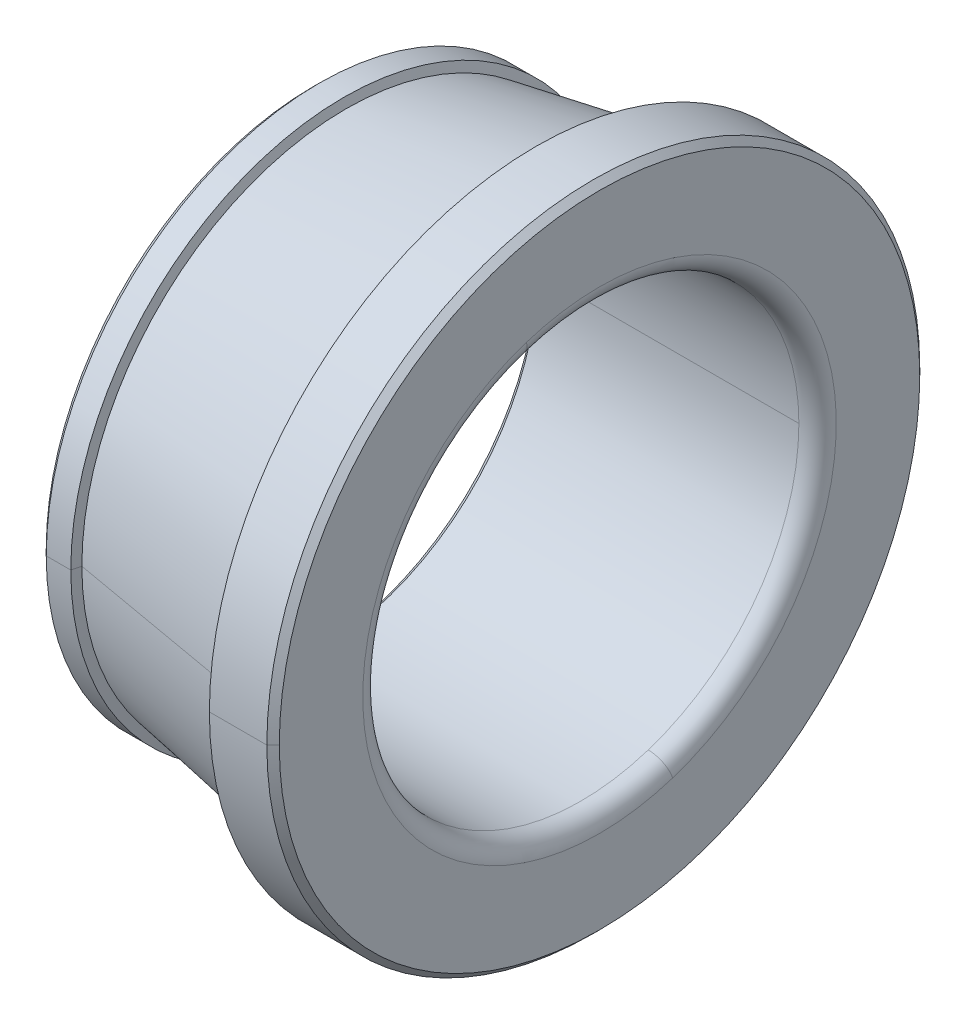
ISO-10303-21;
HEADER;
FILE_DESCRIPTION(('STEP AP214'),'2;1');
FILE_NAME('part.step','',(''),(''),'','','');
FILE_SCHEMA(('AUTOMOTIVE_DESIGN { 1 0 10303 214 1 1 1 1 }'));
ENDSEC;
DATA;
#1=APPLICATION_CONTEXT('core data for automotive mechanical design processes');
#2=APPLICATION_PROTOCOL_DEFINITION('international standard','automotive_design',2000,#1);
#3=PRODUCT_CONTEXT('',#1,'mechanical');
#4=PRODUCT('Part','Part','',(#3));
#5=PRODUCT_RELATED_PRODUCT_CATEGORY('part','',(#4));
#6=PRODUCT_DEFINITION_FORMATION('','',#4);
#7=PRODUCT_DEFINITION_CONTEXT('part definition',#1,'design');
#8=PRODUCT_DEFINITION('design','',#6,#7);
#9=PRODUCT_DEFINITION_SHAPE('','',#8);
#10=(LENGTH_UNIT() NAMED_UNIT(*) SI_UNIT(.MILLI.,.METRE.));
#11=(NAMED_UNIT(*) PLANE_ANGLE_UNIT() SI_UNIT($,.RADIAN.));
#12=(NAMED_UNIT(*) SI_UNIT($,.STERADIAN.) SOLID_ANGLE_UNIT());
#13=UNCERTAINTY_MEASURE_WITH_UNIT(LENGTH_MEASURE(1.E-05),#10,'distance_accuracy_value','');
#14=(GEOMETRIC_REPRESENTATION_CONTEXT(3) GLOBAL_UNCERTAINTY_ASSIGNED_CONTEXT((#13)) GLOBAL_UNIT_ASSIGNED_CONTEXT((#10,
#11,#12)) REPRESENTATION_CONTEXT('',''));
#15=CARTESIAN_POINT('',(0.,0.,0.));
#16=DIRECTION('',(0.,0.,1.));
#17=DIRECTION('',(1.,0.,0.));
#18=AXIS2_PLACEMENT_3D('',#15,#16,#17);
#19=CARTESIAN_POINT('',(1.25,21.403,0.));
#20=DIRECTION('',(-1.,0.,0.));
#21=DIRECTION('',(0.,0.,1.));
#22=AXIS2_PLACEMENT_3D('',#19,#20,#21);
#23=PLANE('',#22);
#24=CARTESIAN_POINT('',(1.25,0.,0.));
#25=DIRECTION('',(1.,0.,0.));
#26=DIRECTION('',(0.,0.,-1.));
#27=AXIS2_PLACEMENT_3D('',#24,#25,#26);
#28=CIRCLE('',#27,18.);
#29=CARTESIAN_POINT('',(1.25,0.,-18.));
#30=VERTEX_POINT('',#29);
#31=CARTESIAN_POINT('',(1.25,0.,18.));
#32=VERTEX_POINT('',#31);
#33=EDGE_CURVE('E11',#30,#32,#28,.T.);
#34=ORIENTED_EDGE('',*,*,#33,.T.);
#35=CARTESIAN_POINT('',(1.25,0.,0.));
#36=DIRECTION('',(1.,0.,0.));
#37=DIRECTION('',(0.,0.,-1.));
#38=AXIS2_PLACEMENT_3D('',#35,#36,#37);
#39=CIRCLE('',#38,18.);
#40=EDGE_CURVE('E25',#32,#30,#39,.T.);
#41=ORIENTED_EDGE('',*,*,#40,.T.);
#42=EDGE_LOOP('',(#34,#41));
#43=FACE_BOUND('',#42,.T.);
#44=CARTESIAN_POINT('',(1.25,0.,0.));
#45=DIRECTION('',(1.,0.,0.));
#46=DIRECTION('',(0.,0.,-1.));
#47=AXIS2_PLACEMENT_3D('',#44,#45,#46);
#48=CIRCLE('',#47,21.403);
#49=CARTESIAN_POINT('',(1.25,0.,21.403));
#50=VERTEX_POINT('',#49);
#51=CARTESIAN_POINT('',(1.25,0.,-21.403));
#52=VERTEX_POINT('',#51);
#53=EDGE_CURVE('E371',#50,#52,#48,.T.);
#54=ORIENTED_EDGE('',*,*,#53,.F.);
#55=CARTESIAN_POINT('',(1.25,0.,0.));
#56=DIRECTION('',(1.,0.,0.));
#57=DIRECTION('',(0.,0.,-1.));
#58=AXIS2_PLACEMENT_3D('',#55,#56,#57);
#59=CIRCLE('',#58,21.403);
#60=EDGE_CURVE('E366',#52,#50,#59,.T.);
#61=ORIENTED_EDGE('',*,*,#60,.F.);
#62=EDGE_LOOP('',(#54,#61));
#63=FACE_BOUND('',#62,.T.);
#64=ADVANCED_FACE('F17',(#43,#63),#23,.T.);
#65=CARTESIAN_POINT('',(1.75,0.,0.));
#66=DIRECTION('',(1.,0.,0.));
#67=DIRECTION('',(0.,-1.,0.));
#68=AXIS2_PLACEMENT_3D('',#65,#66,#67);
#69=CONICAL_SURFACE('',#68,21.903,0.785398163397448);
#70=DIRECTION('',(0.707106781186548,0.,0.707106781186548));
#71=VECTOR('',#70,1.);
#72=CARTESIAN_POINT('',(1.25,0.,21.403));
#73=LINE('',#72,#71);
#74=CARTESIAN_POINT('',(1.75,0.,21.903));
#75=VERTEX_POINT('',#74);
#76=EDGE_CURVE('E362',#50,#75,#73,.T.);
#77=ORIENTED_EDGE('',*,*,#76,.T.);
#78=CARTESIAN_POINT('',(1.75,0.,0.));
#79=DIRECTION('',(1.,0.,0.));
#80=DIRECTION('',(0.,0.,-1.));
#81=AXIS2_PLACEMENT_3D('',#78,#79,#80);
#82=CIRCLE('',#81,21.903);
#83=CARTESIAN_POINT('',(1.75,0.,-21.903));
#84=VERTEX_POINT('',#83);
#85=EDGE_CURVE('E357',#84,#75,#82,.T.);
#86=ORIENTED_EDGE('',*,*,#85,.F.);
#87=DIRECTION('',(0.707106781186548,0.,-0.707106781186548));
#88=VECTOR('',#87,1.);
#89=CARTESIAN_POINT('',(1.25,0.,-21.403));
#90=LINE('',#89,#88);
#91=EDGE_CURVE('E352',#52,#84,#90,.T.);
#92=ORIENTED_EDGE('',*,*,#91,.F.);
#93=ORIENTED_EDGE('',*,*,#60,.T.);
#94=EDGE_LOOP('',(#77,#86,#92,#93));
#95=FACE_BOUND('',#94,.T.);
#96=ADVANCED_FACE('F387',(#95),#69,.T.);
#97=CARTESIAN_POINT('',(1.75,0.,0.));
#98=DIRECTION('',(1.,0.,0.));
#99=DIRECTION('',(0.,1.,0.));
#100=AXIS2_PLACEMENT_3D('',#97,#98,#99);
#101=CONICAL_SURFACE('',#100,21.903,0.785398163397448);
#102=ORIENTED_EDGE('',*,*,#76,.F.);
#103=ORIENTED_EDGE('',*,*,#53,.T.);
#104=ORIENTED_EDGE('',*,*,#91,.T.);
#105=CARTESIAN_POINT('',(1.75,0.,0.));
#106=DIRECTION('',(1.,0.,0.));
#107=DIRECTION('',(0.,0.,-1.));
#108=AXIS2_PLACEMENT_3D('',#105,#106,#107);
#109=CIRCLE('',#108,21.903);
#110=EDGE_CURVE('E347',#75,#84,#109,.T.);
#111=ORIENTED_EDGE('',*,*,#110,.F.);
#112=EDGE_LOOP('',(#102,#103,#104,#111));
#113=FACE_BOUND('',#112,.T.);
#114=ADVANCED_FACE('F382',(#113),#101,.T.);
#115=CARTESIAN_POINT('',(24.25,0.,0.));
#116=DIRECTION('',(1.,0.,0.));
#117=DIRECTION('',(0.,1.,0.));
#118=AXIS2_PLACEMENT_3D('',#115,#116,#117);
#119=CYLINDRICAL_SURFACE('',#118,21.903);
#120=DIRECTION('',(1.,0.,0.));
#121=VECTOR('',#120,1.);
#122=CARTESIAN_POINT('',(1.75,0.,21.903));
#123=LINE('',#122,#121);
#124=CARTESIAN_POINT('',(3.7205763986054,0.,21.903));
#125=VERTEX_POINT('',#124);
#126=EDGE_CURVE('E342',#75,#125,#123,.T.);
#127=ORIENTED_EDGE('',*,*,#126,.F.);
#128=ORIENTED_EDGE('',*,*,#110,.T.);
#129=DIRECTION('',(1.,0.,0.));
#130=VECTOR('',#129,1.);
#131=CARTESIAN_POINT('',(1.75,0.,-21.903));
#132=LINE('',#131,#130);
#133=CARTESIAN_POINT('',(3.7205763986054,0.,-21.903));
#134=VERTEX_POINT('',#133);
#135=EDGE_CURVE('E338',#84,#134,#132,.T.);
#136=ORIENTED_EDGE('',*,*,#135,.T.);
#137=CARTESIAN_POINT('',(3.7205763986054,0.,0.));
#138=DIRECTION('',(1.,0.,0.));
#139=DIRECTION('',(0.,0.,-1.));
#140=AXIS2_PLACEMENT_3D('',#137,#138,#139);
#141=CIRCLE('',#140,21.903);
#142=EDGE_CURVE('E333',#125,#134,#141,.T.);
#143=ORIENTED_EDGE('',*,*,#142,.F.);
#144=EDGE_LOOP('',(#127,#128,#136,#143));
#145=FACE_BOUND('',#144,.T.);
#146=ADVANCED_FACE('F394',(#145),#119,.T.);
#147=CARTESIAN_POINT('',(3.8979340937361,0.,0.));
#148=DIRECTION('',(-1.,0.,0.));
#149=DIRECTION('',(0.,1.,0.));
#150=AXIS2_PLACEMENT_3D('',#147,#148,#149);
#151=CONICAL_SURFACE('',#150,21.193556407226,1.32582191298479);
#152=DIRECTION('',(-0.242531502591365,0.,-0.970143530747268));
#153=VECTOR('',#152,1.);
#154=CARTESIAN_POINT('',(3.8979340937361,0.,-21.193556407226));
#155=LINE('',#154,#153);
#156=CARTESIAN_POINT('',(3.8979340937361,0.,-21.193556407226));
#157=VERTEX_POINT('',#156);
#158=EDGE_CURVE('E328',#157,#134,#155,.T.);
#159=ORIENTED_EDGE('',*,*,#158,.F.);
#160=CARTESIAN_POINT('',(3.8979340937361,0.,0.));
#161=DIRECTION('',(1.,0.,0.));
#162=DIRECTION('',(0.,0.,-1.));
#163=AXIS2_PLACEMENT_3D('',#160,#161,#162);
#164=CIRCLE('',#163,21.193556407226);
#165=CARTESIAN_POINT('',(3.8979340937361,0.,21.193556407226));
#166=VERTEX_POINT('',#165);
#167=EDGE_CURVE('E323',#166,#157,#164,.T.);
#168=ORIENTED_EDGE('',*,*,#167,.F.);
#169=DIRECTION('',(-0.242531502591365,0.,0.970143530747268));
#170=VECTOR('',#169,1.);
#171=CARTESIAN_POINT('',(3.8979340937361,0.,21.193556407226));
#172=LINE('',#171,#170);
#173=EDGE_CURVE('E318',#166,#125,#172,.T.);
#174=ORIENTED_EDGE('',*,*,#173,.T.);
#175=ORIENTED_EDGE('',*,*,#142,.T.);
#176=EDGE_LOOP('',(#159,#168,#174,#175));
#177=FACE_BOUND('',#176,.T.);
#178=ADVANCED_FACE('F396',(#177),#151,.T.);
#179=CARTESIAN_POINT('',(3.8979340937361,0.,0.));
#180=DIRECTION('',(-1.,0.,0.));
#181=DIRECTION('',(0.,-1.,0.));
#182=AXIS2_PLACEMENT_3D('',#179,#180,#181);
#183=CONICAL_SURFACE('',#182,21.193556407226,1.32582191298479);
#184=ORIENTED_EDGE('',*,*,#158,.T.);
#185=CARTESIAN_POINT('',(3.7205763986054,0.,0.));
#186=DIRECTION('',(1.,0.,0.));
#187=DIRECTION('',(0.,0.,-1.));
#188=AXIS2_PLACEMENT_3D('',#185,#186,#187);
#189=CIRCLE('',#188,21.903);
#190=EDGE_CURVE('E313',#134,#125,#189,.T.);
#191=ORIENTED_EDGE('',*,*,#190,.T.);
#192=ORIENTED_EDGE('',*,*,#173,.F.);
#193=CARTESIAN_POINT('',(3.8979340937361,0.,0.));
#194=DIRECTION('',(1.,0.,0.));
#195=DIRECTION('',(0.,0.,-1.));
#196=AXIS2_PLACEMENT_3D('',#193,#194,#195);
#197=CIRCLE('',#196,21.193556407226);
#198=EDGE_CURVE('E308',#157,#166,#197,.T.);
#199=ORIENTED_EDGE('',*,*,#198,.F.);
#200=EDGE_LOOP('',(#184,#191,#192,#199));
#201=FACE_BOUND('',#200,.T.);
#202=ADVANCED_FACE('F401',(#201),#183,.T.);
#203=CARTESIAN_POINT('',(19.692398578943,0.,0.));
#204=DIRECTION('',(1.,0.,0.));
#205=DIRECTION('',(0.,-1.,0.));
#206=AXIS2_PLACEMENT_3D('',#203,#204,#205);
#207=CONICAL_SURFACE('',#206,23.985368814372,0.174951804219879);
#208=DIRECTION('',(0.984734929038769,0.,0.174060677727654));
#209=VECTOR('',#208,1.);
#210=CARTESIAN_POINT('',(3.89793409373609,0.,21.193556407226));
#211=LINE('',#210,#209);
#212=CARTESIAN_POINT('',(19.692398578943,0.,23.985368814372));
#213=VERTEX_POINT('',#212);
#214=EDGE_CURVE('E304',#166,#213,#211,.T.);
#215=ORIENTED_EDGE('',*,*,#214,.T.);
#216=CARTESIAN_POINT('',(19.692398578943,0.,0.));
#217=DIRECTION('',(1.,0.,0.));
#218=DIRECTION('',(0.,0.,-1.));
#219=AXIS2_PLACEMENT_3D('',#216,#217,#218);
#220=CIRCLE('',#219,23.985368814372);
#221=CARTESIAN_POINT('',(19.692398578943,0.,-23.985368814372));
#222=VERTEX_POINT('',#221);
#223=EDGE_CURVE('E299',#222,#213,#220,.T.);
#224=ORIENTED_EDGE('',*,*,#223,.F.);
#225=DIRECTION('',(0.984734929038769,0.,-0.174060677727654));
#226=VECTOR('',#225,1.);
#227=CARTESIAN_POINT('',(3.89793409373609,0.,-21.193556407226));
#228=LINE('',#227,#226);
#229=EDGE_CURVE('E294',#157,#222,#228,.T.);
#230=ORIENTED_EDGE('',*,*,#229,.F.);
#231=ORIENTED_EDGE('',*,*,#198,.T.);
#232=EDGE_LOOP('',(#215,#224,#230,#231));
#233=FACE_BOUND('',#232,.T.);
#234=ADVANCED_FACE('F408',(#233),#207,.T.);
#235=CARTESIAN_POINT('',(19.692398578943,0.,0.));
#236=DIRECTION('',(1.,0.,0.));
#237=DIRECTION('',(0.,1.,0.));
#238=AXIS2_PLACEMENT_3D('',#235,#236,#237);
#239=CONICAL_SURFACE('',#238,23.985368814372,0.174951804219879);
#240=ORIENTED_EDGE('',*,*,#214,.F.);
#241=ORIENTED_EDGE('',*,*,#167,.T.);
#242=ORIENTED_EDGE('',*,*,#229,.T.);
#243=CARTESIAN_POINT('',(19.692398578943,0.,0.));
#244=DIRECTION('',(1.,0.,0.));
#245=DIRECTION('',(0.,0.,-1.));
#246=AXIS2_PLACEMENT_3D('',#243,#244,#245);
#247=CIRCLE('',#246,23.985368814372);
#248=EDGE_CURVE('E289',#213,#222,#247,.T.);
#249=ORIENTED_EDGE('',*,*,#248,.F.);
#250=EDGE_LOOP('',(#240,#241,#242,#249));
#251=FACE_BOUND('',#250,.T.);
#252=ADVANCED_FACE('F405',(#251),#239,.T.);
#253=CARTESIAN_POINT('',(19.138750781362,0.,0.));
#254=DIRECTION('',(-1.,0.,0.));
#255=DIRECTION('',(0.,1.,0.));
#256=AXIS2_PLACEMENT_3D('',#253,#254,#255);
#257=CONICAL_SURFACE('',#256,26.2,1.32582191298495);
#258=DIRECTION('',(-0.242531502591207,0.,-0.970143530747307));
#259=VECTOR('',#258,1.);
#260=CARTESIAN_POINT('',(19.692398578943,0.,-23.985368814372));
#261=LINE('',#260,#259);
#262=CARTESIAN_POINT('',(19.138750781362,0.,-26.2));
#263=VERTEX_POINT('',#262);
#264=EDGE_CURVE('E285',#222,#263,#261,.T.);
#265=ORIENTED_EDGE('',*,*,#264,.T.);
#266=CARTESIAN_POINT('',(19.138750781362,0.,0.));
#267=DIRECTION('',(1.,0.,0.));
#268=DIRECTION('',(0.,0.,-1.));
#269=AXIS2_PLACEMENT_3D('',#266,#267,#268);
#270=CIRCLE('',#269,26.2);
#271=CARTESIAN_POINT('',(19.138750781362,0.,26.2));
#272=VERTEX_POINT('',#271);
#273=EDGE_CURVE('E280',#272,#263,#270,.T.);
#274=ORIENTED_EDGE('',*,*,#273,.F.);
#275=DIRECTION('',(-0.242531502591207,0.,0.970143530747307));
#276=VECTOR('',#275,1.);
#277=CARTESIAN_POINT('',(19.692398578943,0.,23.985368814372));
#278=LINE('',#277,#276);
#279=EDGE_CURVE('E275',#213,#272,#278,.T.);
#280=ORIENTED_EDGE('',*,*,#279,.F.);
#281=ORIENTED_EDGE('',*,*,#248,.T.);
#282=EDGE_LOOP('',(#265,#274,#280,#281));
#283=FACE_BOUND('',#282,.T.);
#284=ADVANCED_FACE('F410',(#283),#257,.F.);
#285=CARTESIAN_POINT('',(19.138750781362,0.,0.));
#286=DIRECTION('',(-1.,0.,0.));
#287=DIRECTION('',(0.,-1.,0.));
#288=AXIS2_PLACEMENT_3D('',#285,#286,#287);
#289=CONICAL_SURFACE('',#288,26.2,1.32582191298495);
#290=ORIENTED_EDGE('',*,*,#264,.F.);
#291=ORIENTED_EDGE('',*,*,#223,.T.);
#292=ORIENTED_EDGE('',*,*,#279,.T.);
#293=CARTESIAN_POINT('',(19.138750781362,0.,0.));
#294=DIRECTION('',(1.,0.,0.));
#295=DIRECTION('',(0.,0.,-1.));
#296=AXIS2_PLACEMENT_3D('',#293,#294,#295);
#297=CIRCLE('',#296,26.2);
#298=EDGE_CURVE('E270',#263,#272,#297,.T.);
#299=ORIENTED_EDGE('',*,*,#298,.F.);
#300=EDGE_LOOP('',(#290,#291,#292,#299));
#301=FACE_BOUND('',#300,.T.);
#302=ADVANCED_FACE('F415',(#301),#289,.F.);
#303=CARTESIAN_POINT('',(24.25,0.,0.));
#304=DIRECTION('',(1.,0.,0.));
#305=DIRECTION('',(0.,-1.,0.));
#306=AXIS2_PLACEMENT_3D('',#303,#304,#305);
#307=CYLINDRICAL_SURFACE('',#306,26.2);
#308=DIRECTION('',(1.,0.,0.));
#309=VECTOR('',#308,1.);
#310=CARTESIAN_POINT('',(19.138750781362,0.,26.2));
#311=LINE('',#310,#309);
#312=CARTESIAN_POINT('',(23.75,0.,26.2));
#313=VERTEX_POINT('',#312);
#314=EDGE_CURVE('E266',#272,#313,#311,.T.);
#315=ORIENTED_EDGE('',*,*,#314,.T.);
#316=CARTESIAN_POINT('',(23.75,0.,0.));
#317=DIRECTION('',(1.,0.,0.));
#318=DIRECTION('',(0.,0.,-1.));
#319=AXIS2_PLACEMENT_3D('',#316,#317,#318);
#320=CIRCLE('',#319,26.2);
#321=CARTESIAN_POINT('',(23.75,0.,-26.2));
#322=VERTEX_POINT('',#321);
#323=EDGE_CURVE('E261',#322,#313,#320,.T.);
#324=ORIENTED_EDGE('',*,*,#323,.F.);
#325=DIRECTION('',(1.,0.,0.));
#326=VECTOR('',#325,1.);
#327=CARTESIAN_POINT('',(19.138750781362,0.,-26.2));
#328=LINE('',#327,#326);
#329=EDGE_CURVE('E256',#263,#322,#328,.T.);
#330=ORIENTED_EDGE('',*,*,#329,.F.);
#331=ORIENTED_EDGE('',*,*,#298,.T.);
#332=EDGE_LOOP('',(#315,#324,#330,#331));
#333=FACE_BOUND('',#332,.T.);
#334=ADVANCED_FACE('F421',(#333),#307,.T.);
#335=CARTESIAN_POINT('',(24.25,0.,0.));
#336=DIRECTION('',(1.,0.,0.));
#337=DIRECTION('',(0.,1.,0.));
#338=AXIS2_PLACEMENT_3D('',#335,#336,#337);
#339=CYLINDRICAL_SURFACE('',#338,26.2);
#340=ORIENTED_EDGE('',*,*,#314,.F.);
#341=ORIENTED_EDGE('',*,*,#273,.T.);
#342=ORIENTED_EDGE('',*,*,#329,.T.);
#343=CARTESIAN_POINT('',(23.75,0.,0.));
#344=DIRECTION('',(1.,0.,0.));
#345=DIRECTION('',(0.,0.,-1.));
#346=AXIS2_PLACEMENT_3D('',#343,#344,#345);
#347=CIRCLE('',#346,26.2);
#348=EDGE_CURVE('E251',#313,#322,#347,.T.);
#349=ORIENTED_EDGE('',*,*,#348,.F.);
#350=EDGE_LOOP('',(#340,#341,#342,#349));
#351=FACE_BOUND('',#350,.T.);
#352=ADVANCED_FACE('F419',(#351),#339,.T.);
#353=CARTESIAN_POINT('',(24.25,0.,0.));
#354=DIRECTION('',(-1.,0.,0.));
#355=DIRECTION('',(0.,1.,0.));
#356=AXIS2_PLACEMENT_3D('',#353,#354,#355);
#357=CONICAL_SURFACE('',#356,25.7,0.785398163397448);
#358=DIRECTION('',(-0.707106781186548,0.,-0.707106781186548));
#359=VECTOR('',#358,1.);
#360=CARTESIAN_POINT('',(24.25,0.,-25.7));
#361=LINE('',#360,#359);
#362=CARTESIAN_POINT('',(24.25,0.,-25.7));
#363=VERTEX_POINT('',#362);
#364=EDGE_CURVE('E246',#363,#322,#361,.T.);
#365=ORIENTED_EDGE('',*,*,#364,.F.);
#366=CARTESIAN_POINT('',(24.25,0.,0.));
#367=DIRECTION('',(1.,0.,0.));
#368=DIRECTION('',(0.,0.,-1.));
#369=AXIS2_PLACEMENT_3D('',#366,#367,#368);
#370=CIRCLE('',#369,25.7);
#371=CARTESIAN_POINT('',(24.25,0.,25.7));
#372=VERTEX_POINT('',#371);
#373=EDGE_CURVE('E241',#372,#363,#370,.T.);
#374=ORIENTED_EDGE('',*,*,#373,.F.);
#375=DIRECTION('',(-0.707106781186548,0.,0.707106781186548));
#376=VECTOR('',#375,1.);
#377=CARTESIAN_POINT('',(24.25,0.,25.7));
#378=LINE('',#377,#376);
#379=EDGE_CURVE('E236',#372,#313,#378,.T.);
#380=ORIENTED_EDGE('',*,*,#379,.T.);
#381=ORIENTED_EDGE('',*,*,#348,.T.);
#382=EDGE_LOOP('',(#365,#374,#380,#381));
#383=FACE_BOUND('',#382,.T.);
#384=ADVANCED_FACE('F427',(#383),#357,.T.);
#385=CARTESIAN_POINT('',(24.25,0.,0.));
#386=DIRECTION('',(-1.,0.,0.));
#387=DIRECTION('',(0.,-1.,0.));
#388=AXIS2_PLACEMENT_3D('',#385,#386,#387);
#389=CONICAL_SURFACE('',#388,25.7,0.785398163397448);
#390=ORIENTED_EDGE('',*,*,#364,.T.);
#391=ORIENTED_EDGE('',*,*,#323,.T.);
#392=ORIENTED_EDGE('',*,*,#379,.F.);
#393=CARTESIAN_POINT('',(24.25,0.,0.));
#394=DIRECTION('',(1.,0.,0.));
#395=DIRECTION('',(0.,0.,-1.));
#396=AXIS2_PLACEMENT_3D('',#393,#394,#395);
#397=CIRCLE('',#396,25.7);
#398=EDGE_CURVE('E233',#363,#372,#397,.T.);
#399=ORIENTED_EDGE('',*,*,#398,.F.);
#400=EDGE_LOOP('',(#390,#391,#392,#399));
#401=FACE_BOUND('',#400,.T.);
#402=ADVANCED_FACE('F424',(#401),#389,.T.);
#403=CARTESIAN_POINT('',(24.25,19.,0.));
#404=DIRECTION('',(1.,0.,0.));
#405=DIRECTION('',(0.,0.,-1.));
#406=AXIS2_PLACEMENT_3D('',#403,#404,#405);
#407=PLANE('',#406);
#408=ORIENTED_EDGE('',*,*,#398,.T.);
#409=ORIENTED_EDGE('',*,*,#373,.T.);
#410=EDGE_LOOP('',(#408,#409));
#411=FACE_BOUND('',#410,.T.);
#412=CARTESIAN_POINT('',(24.25,-18.0700738096073,-5.87132289312385));
#413=CARTESIAN_POINT('',(24.25,-17.9740106883257,-6.1669961208765));
#414=CARTESIAN_POINT('',(24.25,-17.8706785644181,-6.46030691648312));
#415=CARTESIAN_POINT('',(24.25,-17.6497523450558,-7.04150733217232));
#416=CARTESIAN_POINT('',(24.25,-17.532158249601,-7.3293969522549));
#417=CARTESIAN_POINT('',(24.25,-17.282984120849,-7.89905870566403));
#418=CARTESIAN_POINT('',(24.25,-17.1514040875517,-8.18083083899057));
#419=CARTESIAN_POINT('',(24.25,-16.8745770164577,-8.73757954465673));
#420=CARTESIAN_POINT('',(24.25,-16.7293299786609,-9.01255611699636));
#421=CARTESIAN_POINT('',(24.25,-16.4255182901043,-9.55505105988739));
#422=CARTESIAN_POINT('',(24.25,-16.2669536393443,-9.8225694304388));
#423=CARTESIAN_POINT('',(24.25,-15.9368888606755,-10.349503547662));
#424=CARTESIAN_POINT('',(24.25,-15.7653887327666,-10.6089192943337));
#425=CARTESIAN_POINT('',(24.25,-15.4098661212019,-11.1190231943149));
#426=CARTESIAN_POINT('',(24.25,-15.2258436375461,-11.3697113476243));
#427=CARTESIAN_POINT('',(24.25,-14.845719650798,-11.861756134974));
#428=CARTESIAN_POINT('',(24.25,-14.6496181477056,-12.1031127690142));
#429=CARTESIAN_POINT('',(24.25,-14.2458085450946,-12.5759130675321));
#430=CARTESIAN_POINT('',(24.25,-14.0381004455759,-12.8073567320098));
#431=CARTESIAN_POINT('',(24.25,-13.611578037837,-13.2597735236167));
#432=CARTESIAN_POINT('',(24.25,-13.3927637296169,-13.4807466507459));
#433=CARTESIAN_POINT('',(24.25,-12.9445560471164,-13.9116900239642));
#434=CARTESIAN_POINT('',(24.25,-12.7151626728362,-14.1216602700532));
#435=CARTESIAN_POINT('',(24.25,-12.2463494869985,-14.5300920444969));
#436=CARTESIAN_POINT('',(24.25,-12.0069296754411,-14.7285535728515));
#437=CARTESIAN_POINT('',(24.25,-11.5186403983318,-15.1134898006159));
#438=CARTESIAN_POINT('',(24.25,-11.26977093278,-15.2999645000257));
#439=CARTESIAN_POINT('',(24.25,-10.7631818960268,-15.6604778360179));
#440=CARTESIAN_POINT('',(24.25,-10.5054623248252,-15.8345164726003));
#441=CARTESIAN_POINT('',(24.25,-9.9817939457921,-16.1697384086176));
#442=CARTESIAN_POINT('',(24.25,-9.71584513796047,-16.3309217080526));
#443=CARTESIAN_POINT('',(24.25,-9.17635897963978,-16.640044665089));
#444=CARTESIAN_POINT('',(24.25,-8.90282162915072,-16.7879843226904));
#445=CARTESIAN_POINT('',(24.25,-8.34881736095149,-17.0702635964665));
#446=CARTESIAN_POINT('',(24.25,-8.06835044324131,-17.2046032126411));
#447=CARTESIAN_POINT('',(24.25,-7.5011627099706,-17.4593587676615));
#448=CARTESIAN_POINT('',(24.25,-7.21444189441008,-17.5797747065073));
#449=CARTESIAN_POINT('',(24.25,-6.63543710099715,-17.8063928143261));
#450=CARTESIAN_POINT('',(24.25,-6.34315312314475,-17.9125949832991));
#451=CARTESIAN_POINT('',(24.25,-5.75372614285175,-18.1105297010451));
#452=CARTESIAN_POINT('',(24.25,-5.45658314041116,-18.2022622498181));
#453=CARTESIAN_POINT('',(24.25,-4.85815395446133,-18.3710367354193));
#454=CARTESIAN_POINT('',(24.25,-4.55686777095209,-18.4480786722475));
#455=CARTESIAN_POINT('',(24.25,-3.95087804767059,-18.5872863331851));
#456=CARTESIAN_POINT('',(24.25,-3.64617450789832,-18.6494520572945));
#457=CARTESIAN_POINT('',(24.25,-3.03408412960695,-18.7587575301202));
#458=CARTESIAN_POINT('',(24.25,-2.72669729108785,-18.8058972788364));
#459=CARTESIAN_POINT('',(24.25,-2.10998083712071,-18.8850372370921));
#460=CARTESIAN_POINT('',(24.25,-1.80065122167267,-18.9170374466316));
#461=CARTESIAN_POINT('',(24.25,-1.18079441598535,-18.9658212352261));
#462=CARTESIAN_POINT('',(24.25,-0.870267225746063,-18.982604814281));
#463=CARTESIAN_POINT('',(24.25,-0.248763357676506,-19.0009149087946));
#464=CARTESIAN_POINT('',(24.25,0.0622133201537652,-19.0024414242531));
#465=CARTESIAN_POINT('',(24.25,0.683866993350071,-18.9902337140642));
#466=CARTESIAN_POINT('',(24.25,0.994543988716105,-18.9764994884168));
#467=CARTESIAN_POINT('',(24.25,1.61484984889,-18.9338033829686));
#468=CARTESIAN_POINT('',(24.25,1.92447871369786,-18.9048415031678));
#469=CARTESIAN_POINT('',(24.25,2.5419423896998,-18.8317598611182));
#470=CARTESIAN_POINT('',(24.25,2.84977720089388,-18.7876400988692));
#471=CARTESIAN_POINT('',(24.25,3.46291116864497,-18.6843489802949));
#472=CARTESIAN_POINT('',(24.25,3.76821032520196,-18.6251776239695));
#473=CARTESIAN_POINT('',(24.25,4.37553749126967,-18.4919258662225));
#474=CARTESIAN_POINT('',(24.25,4.67756550078038,-18.4178454648008));
#475=CARTESIAN_POINT('',(24.25,5.27762276082609,-18.2549540830369));
#476=CARTESIAN_POINT('',(24.25,5.57565201136108,-18.1661431026946));
#477=CARTESIAN_POINT('',(24.25,6.16699377488651,-17.9740045165201));
#478=CARTESIAN_POINT('',(24.25,6.46030628787696,-17.8706769106878));
#479=CARTESIAN_POINT('',(24.25,7.04150796077838,-17.6497539987862));
#480=CARTESIAN_POINT('',(24.25,7.32939712068935,-17.5321586927168));
#481=CARTESIAN_POINT('',(24.25,7.89905853722948,-17.2829836777333));
#482=CARTESIAN_POINT('',(24.25,8.18083079385864,-17.1514039688192));
#483=CARTESIAN_POINT('',(24.25,8.73757958978858,-16.8745771351902));
#484=CARTESIAN_POINT('',(24.25,9.01255612908936,-16.7293300104752));
#485=CARTESIAN_POINT('',(24.25,9.55505104779429,-16.42551825829));
#486=CARTESIAN_POINT('',(24.25,9.82256942719843,-16.2669536308198));
#487=CARTESIAN_POINT('',(24.25,10.3495035509022,-15.9368888692002));
#488=CARTESIAN_POINT('',(24.25,10.6089192952019,-15.7653887350508));
#489=CARTESIAN_POINT('',(24.25,11.1190231934466,-15.4098661189178));
#490=CARTESIAN_POINT('',(24.25,11.3697113473917,-15.2258436369341));
#491=CARTESIAN_POINT('',(24.25,11.8617561352066,-14.8457196514101));
#492=CARTESIAN_POINT('',(24.25,12.1031127690765,-14.6496181478697));
#493=CARTESIAN_POINT('',(24.25,12.5759130674697,-14.2458085449306));
#494=CARTESIAN_POINT('',(24.25,12.8073567319931,-14.038100445532));
#495=CARTESIAN_POINT('',(24.25,13.2597735236334,-13.611578037881));
#496=CARTESIAN_POINT('',(24.25,13.4807466507503,-13.3927637296287));
#497=CARTESIAN_POINT('',(24.25,13.9116900239597,-12.9445560471047));
#498=CARTESIAN_POINT('',(24.25,14.121660270052,-12.7151626728331));
#499=CARTESIAN_POINT('',(24.25,14.5300920444981,-12.2463494870017));
#500=CARTESIAN_POINT('',(24.25,14.7285535728518,-12.006929675442));
#501=CARTESIAN_POINT('',(24.25,15.1134898006155,-11.518640398331));
#502=CARTESIAN_POINT('',(24.25,15.2999645000256,-11.2697709327799));
#503=CARTESIAN_POINT('',(24.25,15.660477836018,-10.763181896027));
#504=CARTESIAN_POINT('',(24.25,15.8345164726003,-10.5054623248254));
#505=CARTESIAN_POINT('',(24.25,16.1697384086176,-9.98179394579209));
#506=CARTESIAN_POINT('',(24.25,16.3309217080526,-9.71584513796051));
#507=CARTESIAN_POINT('',(24.25,16.640044665089,-9.17635897963985));
#508=CARTESIAN_POINT('',(24.25,16.7879843226904,-8.90282162915078));
#509=CARTESIAN_POINT('',(24.25,17.0702635964665,-8.34881736095154));
#510=CARTESIAN_POINT('',(24.25,17.2046032126411,-8.06835044324136));
#511=CARTESIAN_POINT('',(24.25,17.4593587676615,-7.50116270997065));
#512=CARTESIAN_POINT('',(24.25,17.5797747065074,-7.21444189441012));
#513=CARTESIAN_POINT('',(24.25,17.806392814326,-6.63543710099722));
#514=CARTESIAN_POINT('',(24.25,17.9125949832989,-6.34315312314486));
#515=CARTESIAN_POINT('',(24.25,18.1105297010454,-5.75372614285174));
#516=CARTESIAN_POINT('',(24.25,18.202262249819,-5.45658314041098));
#517=CARTESIAN_POINT('',(24.25,18.3710367354184,-4.85815395446162));
#518=CARTESIAN_POINT('',(24.25,18.4480786722442,-4.55686777095303));
#519=CARTESIAN_POINT('',(24.25,18.5872863331883,-3.95087804766975));
#520=CARTESIAN_POINT('',(24.25,18.6494520573067,-3.64617450789507));
#521=CARTESIAN_POINT('',(24.25,18.758757530108,-3.03408412961031));
#522=CARTESIAN_POINT('',(24.25,18.8058972787911,-2.72669729110022));
#523=CARTESIAN_POINT('',(24.25,18.8850372371375,-2.10998083710845));
#524=CARTESIAN_POINT('',(24.25,18.9170374468009,-1.80065122162677));
#525=CARTESIAN_POINT('',(24.25,18.9658212350567,-1.18079441603137));
#526=CARTESIAN_POINT('',(24.25,18.9826048136491,-0.870267225917663));
#527=CARTESIAN_POINT('',(24.25,19.0009149094265,-0.248763357505038));
#528=CARTESIAN_POINT('',(24.25,19.0024414266113,0.0622133207938759));
#529=CARTESIAN_POINT('',(24.25,18.9902337117059,0.683866992709833));
#530=CARTESIAN_POINT('',(24.25,18.9764994796156,0.994543986326876));
#531=CARTESIAN_POINT('',(24.25,18.9338033917698,1.6148498512791));
#532=CARTESIAN_POINT('',(24.25,18.9048415360143,1.92447872261428));
#533=CARTESIAN_POINT('',(24.25,18.8317598282718,2.54194238078328));
#534=CARTESIAN_POINT('',(24.25,18.7876399762848,2.8497771676171));
#535=CARTESIAN_POINT('',(24.25,18.6843491028794,3.46291120192167));
#536=CARTESIAN_POINT('',(24.25,18.625178081461,3.76821044939242));
#537=CARTESIAN_POINT('',(24.25,18.491925408731,4.37553736707912));
#538=CARTESIAN_POINT('',(24.25,18.4178437574195,4.67756503729506));
#539=CARTESIAN_POINT('',(24.25,18.2549557904182,5.27762322431132));
#540=CARTESIAN_POINT('',(24.25,18.1661494747286,5.57565374111164));
#541=CARTESIAN_POINT('',(24.25,18.0700738096074,5.87132289312374));
#542=B_SPLINE_CURVE_WITH_KNOTS('',3,(#412,#413,#414,#415,#416,#417,#418,#419,#420,#421,#422,
#423,#424,#425,#426,#427,#428,#429,#430,#431,#432,#433,#434,#435,#436,#437,#438,#439,#440,#441,
#442,#443,#444,#445,#446,#447,#448,#449,#450,#451,#452,#453,#454,#455,#456,#457,#458,#459,#460,
#461,#462,#463,#464,#465,#466,#467,#468,#469,#470,#471,#472,#473,#474,#475,#476,#477,#478,#479,
#480,#481,#482,#483,#484,#485,#486,#487,#488,#489,#490,#491,#492,#493,#494,#495,#496,#497,#498,
#499,#500,#501,#502,#503,#504,#505,#506,#507,#508,#509,#510,#511,#512,#513,#514,#515,#516,#517,
#518,#519,#520,#521,#522,#523,#524,#525,#526,#527,#528,#529,#530,#531,#532,#533,#534,#535,#536,
#537,#538,#539,#540,#541),.UNSPECIFIED.,.F.,.F.,(4,2,2,2,2,2,2,2,2,2,2,2,2,2,2,2,2,2,2,2,2,2,2,
2,2,2,2,2,2,2,2,2,2,2,2,2,2,2,2,2,2,2,2,2,2,2,2,2,2,2,2,2,2,2,2,2,2,2,2,2,2,2,2,2,4),(0.,
0.932566683870634,1.86513336774127,2.79770005161191,3.73026673548254,4.66283341935317,
5.59540010322381,6.52796678709445,7.46053347096509,8.39310015483572,9.32566683870635,
10.258233522577,11.1908002064476,12.1233668903183,13.0559335741889,13.9885002580595,
14.9210669419302,15.8536336258008,16.7862003096714,17.7187669935421,18.6513336774127,
19.5839003612833,20.516467045154,21.4490337290246,22.3816004128953,23.3141670967659,
24.2467337806365,25.1793004645072,26.1118671483778,27.0444338322484,27.9770005161191,
28.9095671999897,29.8421338838603,30.774700567731,31.7072672516016,32.6398339354722,
33.5724006193429,34.5049673032135,35.4375339870842,36.3701006709548,37.3026673548254,
38.2352340386961,39.1678007225667,40.1003674064373,41.032934090308,41.9655007741786,
42.8980674580492,43.8306341419199,44.7632008257905,45.6957675096612,46.6283341935318,
47.5609008774024,48.4934675612731,49.4260342451437,50.3586009290143,51.291167612885,
52.2237342967556,53.1563009806262,54.0888676644969,55.0214343483675,55.9540010322382,
56.8865677161088,57.8191343999794,58.7517010838501,59.6842677677207),.UNSPECIFIED.);
#543=CARTESIAN_POINT('',(24.25,-18.0700738096073,-5.87132289312381));
#544=VERTEX_POINT('',#543);
#545=CARTESIAN_POINT('',(24.25,18.0700738096073,5.87132289312381));
#546=VERTEX_POINT('',#545);
#547=EDGE_CURVE('E232',#544,#546,#542,.T.);
#548=ORIENTED_EDGE('',*,*,#547,.F.);
#549=CARTESIAN_POINT('',(24.25,18.0700738096073,5.87132289312385));
#550=CARTESIAN_POINT('',(24.25,17.9740106883257,6.1669961208765));
#551=CARTESIAN_POINT('',(24.25,17.8706785644181,6.46030691648312));
#552=CARTESIAN_POINT('',(24.25,17.6497523450558,7.04150733217232));
#553=CARTESIAN_POINT('',(24.25,17.532158249601,7.3293969522549));
#554=CARTESIAN_POINT('',(24.25,17.282984120849,7.89905870566403));
#555=CARTESIAN_POINT('',(24.25,17.1514040875517,8.18083083899057));
#556=CARTESIAN_POINT('',(24.25,16.8745770164577,8.73757954465674));
#557=CARTESIAN_POINT('',(24.25,16.7293299786609,9.01255611699636));
#558=CARTESIAN_POINT('',(24.25,16.4255182901043,9.55505105988739));
#559=CARTESIAN_POINT('',(24.25,16.2669536393443,9.8225694304388));
#560=CARTESIAN_POINT('',(24.25,15.9368888606755,10.349503547662));
#561=CARTESIAN_POINT('',(24.25,15.7653887327666,10.6089192943337));
#562=CARTESIAN_POINT('',(24.25,15.4098661212019,11.1190231943149));
#563=CARTESIAN_POINT('',(24.25,15.2258436375461,11.3697113476244));
#564=CARTESIAN_POINT('',(24.25,14.845719650798,11.861756134974));
#565=CARTESIAN_POINT('',(24.25,14.6496181477056,12.1031127690142));
#566=CARTESIAN_POINT('',(24.25,14.2458085450946,12.5759130675321));
#567=CARTESIAN_POINT('',(24.25,14.0381004455759,12.8073567320098));
#568=CARTESIAN_POINT('',(24.25,13.611578037837,13.2597735236167));
#569=CARTESIAN_POINT('',(24.25,13.3927637296168,13.4807466507459));
#570=CARTESIAN_POINT('',(24.25,12.9445560471164,13.9116900239642));
#571=CARTESIAN_POINT('',(24.25,12.7151626728362,14.1216602700533));
#572=CARTESIAN_POINT('',(24.25,12.2463494869985,14.5300920444969));
#573=CARTESIAN_POINT('',(24.25,12.0069296754411,14.7285535728515));
#574=CARTESIAN_POINT('',(24.25,11.5186403983318,15.1134898006159));
#575=CARTESIAN_POINT('',(24.25,11.26977093278,15.2999645000257));
#576=CARTESIAN_POINT('',(24.25,10.7631818960267,15.6604778360179));
#577=CARTESIAN_POINT('',(24.25,10.5054623248252,15.8345164726003));
#578=CARTESIAN_POINT('',(24.25,9.98179394579209,16.1697384086176));
#579=CARTESIAN_POINT('',(24.25,9.71584513796046,16.3309217080526));
#580=CARTESIAN_POINT('',(24.25,9.17635897963977,16.640044665089));
#581=CARTESIAN_POINT('',(24.25,8.90282162915072,16.7879843226904));
#582=CARTESIAN_POINT('',(24.25,8.34881736095148,17.0702635964665));
#583=CARTESIAN_POINT('',(24.25,8.0683504432413,17.2046032126411));
#584=CARTESIAN_POINT('',(24.25,7.50116270997059,17.4593587676615));
#585=CARTESIAN_POINT('',(24.25,7.21444189441007,17.5797747065073));
#586=CARTESIAN_POINT('',(24.25,6.63543710099714,17.8063928143261));
#587=CARTESIAN_POINT('',(24.25,6.34315312314473,17.9125949832991));
#588=CARTESIAN_POINT('',(24.25,5.75372614285173,18.1105297010451));
#589=CARTESIAN_POINT('',(24.25,5.45658314041115,18.2022622498181));
#590=CARTESIAN_POINT('',(24.25,4.85815395446131,18.3710367354193));
#591=CARTESIAN_POINT('',(24.25,4.55686777095207,18.4480786722475));
#592=CARTESIAN_POINT('',(24.25,3.95087804767056,18.5872863331851));
#593=CARTESIAN_POINT('',(24.25,3.64617450789829,18.6494520572945));
#594=CARTESIAN_POINT('',(24.25,3.03408412960692,18.7587575301202));
#595=CARTESIAN_POINT('',(24.25,2.72669729108782,18.8058972788365));
#596=CARTESIAN_POINT('',(24.25,2.10998083712068,18.8850372370922));
#597=CARTESIAN_POINT('',(24.25,1.80065122167264,18.9170374466316));
#598=CARTESIAN_POINT('',(24.25,1.18079441598532,18.9658212352261));
#599=CARTESIAN_POINT('',(24.25,0.870267225746042,18.982604814281));
#600=CARTESIAN_POINT('',(24.25,0.248763357676485,19.0009149087946));
#601=CARTESIAN_POINT('',(24.25,-0.0622133201537888,19.0024414242531));
#602=CARTESIAN_POINT('',(24.25,-0.683866993350094,18.9902337140642));
#603=CARTESIAN_POINT('',(24.25,-0.994543988716126,18.9764994884168));
#604=CARTESIAN_POINT('',(24.25,-1.61484984889002,18.9338033829686));
#605=CARTESIAN_POINT('',(24.25,-1.92447871369788,18.9048415031678));
#606=CARTESIAN_POINT('',(24.25,-2.54194238969983,18.8317598611182));
#607=CARTESIAN_POINT('',(24.25,-2.84977720089391,18.7876400988692));
#608=CARTESIAN_POINT('',(24.25,-3.46291116864499,18.6843489802949));
#609=CARTESIAN_POINT('',(24.25,-3.76821032520199,18.6251776239695));
#610=CARTESIAN_POINT('',(24.25,-4.3755374912697,18.4919258662225));
#611=CARTESIAN_POINT('',(24.25,-4.67756550078042,18.4178454648008));
#612=CARTESIAN_POINT('',(24.25,-5.27762276082612,18.2549540830369));
#613=CARTESIAN_POINT('',(24.25,-5.5756520113611,18.1661431026946));
#614=CARTESIAN_POINT('',(24.25,-6.16699377488654,17.9740045165201));
#615=CARTESIAN_POINT('',(24.25,-6.46030628787699,17.8706769106878));
#616=CARTESIAN_POINT('',(24.25,-7.04150796077841,17.6497539987862));
#617=CARTESIAN_POINT('',(24.25,-7.32939712068938,17.5321586927168));
#618=CARTESIAN_POINT('',(24.25,-7.89905853722951,17.2829836777333));
#619=CARTESIAN_POINT('',(24.25,-8.18083079385866,17.1514039688192));
#620=CARTESIAN_POINT('',(24.25,-8.7375795897886,16.8745771351902));
#621=CARTESIAN_POINT('',(24.25,-9.01255612908939,16.7293300104752));
#622=CARTESIAN_POINT('',(24.25,-9.55505104779431,16.42551825829));
#623=CARTESIAN_POINT('',(24.25,-9.82256942719845,16.2669536308198));
#624=CARTESIAN_POINT('',(24.25,-10.3495035509023,15.9368888692001));
#625=CARTESIAN_POINT('',(24.25,-10.6089192952019,15.7653887350508));
#626=CARTESIAN_POINT('',(24.25,-11.1190231934466,15.4098661189178));
#627=CARTESIAN_POINT('',(24.25,-11.3697113473917,15.2258436369341));
#628=CARTESIAN_POINT('',(24.25,-11.8617561352066,14.84571965141));
#629=CARTESIAN_POINT('',(24.25,-12.1031127690765,14.6496181478696));
#630=CARTESIAN_POINT('',(24.25,-12.5759130674697,14.2458085449306));
#631=CARTESIAN_POINT('',(24.25,-12.8073567319931,14.038100445532));
#632=CARTESIAN_POINT('',(24.25,-13.2597735236334,13.611578037881));
#633=CARTESIAN_POINT('',(24.25,-13.4807466507504,13.3927637296286));
#634=CARTESIAN_POINT('',(24.25,-13.9116900239597,12.9445560471047));
#635=CARTESIAN_POINT('',(24.25,-14.121660270052,12.7151626728331));
#636=CARTESIAN_POINT('',(24.25,-14.5300920444981,12.2463494870017));
#637=CARTESIAN_POINT('',(24.25,-14.7285535728518,12.0069296754419));
#638=CARTESIAN_POINT('',(24.25,-15.1134898006156,11.518640398331));
#639=CARTESIAN_POINT('',(24.25,-15.2999645000256,11.2697709327798));
#640=CARTESIAN_POINT('',(24.25,-15.660477836018,10.763181896027));
#641=CARTESIAN_POINT('',(24.25,-15.8345164726003,10.5054623248253));
#642=CARTESIAN_POINT('',(24.25,-16.1697384086176,9.98179394579205));
#643=CARTESIAN_POINT('',(24.25,-16.3309217080526,9.71584513796046));
#644=CARTESIAN_POINT('',(24.25,-16.640044665089,9.17635897963981));
#645=CARTESIAN_POINT('',(24.25,-16.7879843226904,8.90282162915074));
#646=CARTESIAN_POINT('',(24.25,-17.0702635964665,8.34881736095149));
#647=CARTESIAN_POINT('',(24.25,-17.2046032126411,8.06835044324132));
#648=CARTESIAN_POINT('',(24.25,-17.4593587676616,7.50116270997062));
#649=CARTESIAN_POINT('',(24.25,-17.5797747065074,7.21444189441008));
#650=CARTESIAN_POINT('',(24.25,-17.806392814326,6.63543710099719));
#651=CARTESIAN_POINT('',(24.25,-17.9125949832989,6.34315312314483));
#652=CARTESIAN_POINT('',(24.25,-18.1105297010454,5.7537261428517));
#653=CARTESIAN_POINT('',(24.25,-18.202262249819,5.45658314041093));
#654=CARTESIAN_POINT('',(24.25,-18.3710367354184,4.85815395446157));
#655=CARTESIAN_POINT('',(24.25,-18.4480786722442,4.55686777095298));
#656=CARTESIAN_POINT('',(24.25,-18.5872863331883,3.9508780476697));
#657=CARTESIAN_POINT('',(24.25,-18.6494520573067,3.64617450789502));
#658=CARTESIAN_POINT('',(24.25,-18.758757530108,3.03408412961025));
#659=CARTESIAN_POINT('',(24.25,-18.8058972787911,2.72669729110017));
#660=CARTESIAN_POINT('',(24.25,-18.8850372371375,2.1099808371084));
#661=CARTESIAN_POINT('',(24.25,-18.9170374468009,1.80065122162672));
#662=CARTESIAN_POINT('',(24.25,-18.9658212350567,1.18079441603132));
#663=CARTESIAN_POINT('',(24.25,-18.9826048136492,0.87026722591761));
#664=CARTESIAN_POINT('',(24.25,-19.0009149094265,0.248763357504985));
#665=CARTESIAN_POINT('',(24.25,-19.0024414266113,-0.0622133207939288));
#666=CARTESIAN_POINT('',(24.25,-18.9902337117059,-0.683866992709885));
#667=CARTESIAN_POINT('',(24.25,-18.9764994796156,-0.994543986326928));
#668=CARTESIAN_POINT('',(24.25,-18.9338033917698,-1.61484985127915));
#669=CARTESIAN_POINT('',(24.25,-18.9048415360143,-1.92447872261433));
#670=CARTESIAN_POINT('',(24.25,-18.8317598282718,-2.54194238078333));
#671=CARTESIAN_POINT('',(24.25,-18.7876399762848,-2.84977716761715));
#672=CARTESIAN_POINT('',(24.25,-18.6843491028794,-3.46291120192172));
#673=CARTESIAN_POINT('',(24.25,-18.625178081461,-3.76821044939247));
#674=CARTESIAN_POINT('',(24.25,-18.491925408731,-4.37553736707917));
#675=CARTESIAN_POINT('',(24.25,-18.4178437574194,-4.67756503729511));
#676=CARTESIAN_POINT('',(24.25,-18.2549557904182,-5.27762322431137));
#677=CARTESIAN_POINT('',(24.25,-18.1661494747285,-5.57565374111169));
#678=CARTESIAN_POINT('',(24.25,-18.0700738096074,-5.8713228931238));
#679=B_SPLINE_CURVE_WITH_KNOTS('',3,(#549,#550,#551,#552,#553,#554,#555,#556,#557,#558,#559,
#560,#561,#562,#563,#564,#565,#566,#567,#568,#569,#570,#571,#572,#573,#574,#575,#576,#577,#578,
#579,#580,#581,#582,#583,#584,#585,#586,#587,#588,#589,#590,#591,#592,#593,#594,#595,#596,#597,
#598,#599,#600,#601,#602,#603,#604,#605,#606,#607,#608,#609,#610,#611,#612,#613,#614,#615,#616,
#617,#618,#619,#620,#621,#622,#623,#624,#625,#626,#627,#628,#629,#630,#631,#632,#633,#634,#635,
#636,#637,#638,#639,#640,#641,#642,#643,#644,#645,#646,#647,#648,#649,#650,#651,#652,#653,#654,
#655,#656,#657,#658,#659,#660,#661,#662,#663,#664,#665,#666,#667,#668,#669,#670,#671,#672,#673,
#674,#675,#676,#677,#678),.UNSPECIFIED.,.F.,.F.,(4,2,2,2,2,2,2,2,2,2,2,2,2,2,2,2,2,2,2,2,2,2,2,
2,2,2,2,2,2,2,2,2,2,2,2,2,2,2,2,2,2,2,2,2,2,2,2,2,2,2,2,2,2,2,2,2,2,2,2,2,2,2,2,2,4),(0.,
0.932566683870634,1.86513336774127,2.79770005161191,3.73026673548254,4.66283341935318,
5.59540010322382,6.52796678709445,7.4605334709651,8.39310015483573,9.32566683870636,
10.258233522577,11.1908002064476,12.1233668903183,13.0559335741889,13.9885002580595,
14.9210669419302,15.8536336258008,16.7862003096715,17.7187669935421,18.6513336774127,
19.5839003612834,20.516467045154,21.4490337290246,22.3816004128953,23.3141670967659,
24.2467337806365,25.1793004645072,26.1118671483778,27.0444338322484,27.9770005161191,
28.9095671999897,29.8421338838604,30.774700567731,31.7072672516016,32.6398339354723,
33.5724006193429,34.5049673032135,35.4375339870842,36.3701006709548,37.3026673548255,
38.2352340386961,39.1678007225667,40.1003674064374,41.032934090308,41.9655007741786,
42.8980674580493,43.8306341419199,44.7632008257906,45.6957675096612,46.6283341935318,
47.5609008774025,48.4934675612731,49.4260342451437,50.3586009290144,51.291167612885,
52.2237342967557,53.1563009806263,54.0888676644969,55.0214343483676,55.9540010322382,
56.8865677161088,57.8191343999795,58.7517010838501,59.6842677677208),.UNSPECIFIED.);
#680=EDGE_CURVE('E197',#546,#544,#679,.T.);
#681=ORIENTED_EDGE('',*,*,#680,.F.);
#682=EDGE_LOOP('',(#548,#681));
#683=FACE_BOUND('',#682,.T.);
#684=ADVANCED_FACE('F182',(#411,#683),#407,.T.);
#685=CARTESIAN_POINT('',(22.7500000000006,0.,0.));
#686=DIRECTION('',(1.,0.,0.));
#687=DIRECTION('',(0.,0.309016994374947,-0.951056516295154));
#688=AXIS2_PLACEMENT_3D('',#685,#686,#687);
#689=TOROIDAL_SURFACE('',#688,18.9999999999994,1.49999999999939);
#690=CARTESIAN_POINT('',(22.7500000000006,-18.0700738096073,-5.87132289312381));
#691=DIRECTION('',(0.,0.309016994374948,-0.951056516295154));
#692=DIRECTION('',(-3.97903932025819E-13,0.951056516295154,0.309016994374948));
#693=AXIS2_PLACEMENT_3D('',#690,#691,#692);
#694=CIRCLE('',#693,1.49999999999939);
#695=CARTESIAN_POINT('',(22.75,-16.6434890351652,-5.40779740156158));
#696=VERTEX_POINT('',#695);
#697=EDGE_CURVE('E206',#696,#544,#694,.T.);
#698=ORIENTED_EDGE('',*,*,#697,.F.);
#699=CARTESIAN_POINT('',(22.75,0.,0.));
#700=DIRECTION('',(1.,0.,0.));
#701=DIRECTION('',(0.,0.,-1.));
#702=AXIS2_PLACEMENT_3D('',#699,#700,#701);
#703=CIRCLE('',#702,17.5);
#704=CARTESIAN_POINT('',(22.75,0.,17.5));
#705=VERTEX_POINT('',#704);
#706=EDGE_CURVE('E202',#705,#696,#703,.T.);
#707=ORIENTED_EDGE('',*,*,#706,.F.);
#708=CARTESIAN_POINT('',(22.75,0.,0.));
#709=DIRECTION('',(1.,0.,0.));
#710=DIRECTION('',(0.,0.,-1.));
#711=AXIS2_PLACEMENT_3D('',#708,#709,#710);
#712=CIRCLE('',#711,17.5);
#713=CARTESIAN_POINT('',(22.75,16.6434890351652,5.40779740156158));
#714=VERTEX_POINT('',#713);
#715=EDGE_CURVE('E128',#714,#705,#712,.T.);
#716=ORIENTED_EDGE('',*,*,#715,.F.);
#717=CARTESIAN_POINT('',(22.7500000000006,18.0700738096073,5.87132289312381));
#718=DIRECTION('',(0.,-0.309016994374948,0.951056516295154));
#719=DIRECTION('',(-4.00272407811687E-13,-0.951056516295154,-0.309016994374948));
#720=AXIS2_PLACEMENT_3D('',#717,#718,#719);
#721=CIRCLE('',#720,1.49999999999939);
#722=EDGE_CURVE('E157',#714,#546,#721,.T.);
#723=ORIENTED_EDGE('',*,*,#722,.T.);
#724=ORIENTED_EDGE('',*,*,#680,.T.);
#725=EDGE_LOOP('',(#698,#707,#716,#723,#724));
#726=FACE_BOUND('',#725,.T.);
#727=ADVANCED_FACE('F176',(#726),#689,.T.);
#728=CARTESIAN_POINT('',(22.7500000000006,0.,0.));
#729=DIRECTION('',(1.,0.,0.));
#730=DIRECTION('',(0.,-0.309016994374947,0.951056516295154));
#731=AXIS2_PLACEMENT_3D('',#728,#729,#730);
#732=TOROIDAL_SURFACE('',#731,18.9999999999994,1.49999999999939);
#733=ORIENTED_EDGE('',*,*,#697,.T.);
#734=ORIENTED_EDGE('',*,*,#547,.T.);
#735=ORIENTED_EDGE('',*,*,#722,.F.);
#736=CARTESIAN_POINT('',(22.75,0.,0.));
#737=DIRECTION('',(1.,0.,0.));
#738=DIRECTION('',(0.,0.,-1.));
#739=AXIS2_PLACEMENT_3D('',#736,#737,#738);
#740=CIRCLE('',#739,17.5);
#741=CARTESIAN_POINT('',(22.75,0.,-17.5));
#742=VERTEX_POINT('',#741);
#743=EDGE_CURVE('E153',#742,#714,#740,.T.);
#744=ORIENTED_EDGE('',*,*,#743,.F.);
#745=CARTESIAN_POINT('',(22.75,0.,0.));
#746=DIRECTION('',(1.,0.,0.));
#747=DIRECTION('',(0.,0.,-1.));
#748=AXIS2_PLACEMENT_3D('',#745,#746,#747);
#749=CIRCLE('',#748,17.5);
#750=EDGE_CURVE('E129',#696,#742,#749,.T.);
#751=ORIENTED_EDGE('',*,*,#750,.F.);
#752=EDGE_LOOP('',(#733,#734,#735,#744,#751));
#753=FACE_BOUND('',#752,.T.);
#754=ADVANCED_FACE('F166',(#753),#732,.T.);
#755=CARTESIAN_POINT('',(24.25,0.,0.));
#756=DIRECTION('',(1.,0.,0.));
#757=DIRECTION('',(0.,1.,0.));
#758=AXIS2_PLACEMENT_3D('',#755,#756,#757);
#759=CYLINDRICAL_SURFACE('',#758,17.5);
#760=DIRECTION('',(1.,0.,0.));
#761=VECTOR('',#760,1.);
#762=CARTESIAN_POINT('',(1.75,0.,17.5));
#763=LINE('',#762,#761);
#764=CARTESIAN_POINT('',(1.75,0.,17.5));
#765=VERTEX_POINT('',#764);
#766=EDGE_CURVE('E112',#765,#705,#763,.T.);
#767=ORIENTED_EDGE('',*,*,#766,.T.);
#768=ORIENTED_EDGE('',*,*,#706,.T.);
#769=ORIENTED_EDGE('',*,*,#750,.T.);
#770=DIRECTION('',(1.,0.,0.));
#771=VECTOR('',#770,1.);
#772=CARTESIAN_POINT('',(1.75,0.,-17.5));
#773=LINE('',#772,#771);
#774=CARTESIAN_POINT('',(1.75,0.,-17.5));
#775=VERTEX_POINT('',#774);
#776=EDGE_CURVE('E115',#775,#742,#773,.T.);
#777=ORIENTED_EDGE('',*,*,#776,.F.);
#778=CARTESIAN_POINT('',(1.75,0.,0.));
#779=DIRECTION('',(1.,0.,0.));
#780=DIRECTION('',(0.,0.,-1.));
#781=AXIS2_PLACEMENT_3D('',#778,#779,#780);
#782=CIRCLE('',#781,17.5);
#783=EDGE_CURVE('E108',#765,#775,#782,.T.);
#784=ORIENTED_EDGE('',*,*,#783,.F.);
#785=EDGE_LOOP('',(#767,#768,#769,#777,#784));
#786=FACE_BOUND('',#785,.T.);
#787=ADVANCED_FACE('F110',(#786),#759,.F.);
#788=CARTESIAN_POINT('',(1.25,0.,0.));
#789=DIRECTION('',(-1.,0.,0.));
#790=DIRECTION('',(0.,1.,0.));
#791=AXIS2_PLACEMENT_3D('',#788,#789,#790);
#792=CONICAL_SURFACE('',#791,18.,0.785398163397448);
#793=DIRECTION('',(-0.707106781186548,0.,-0.707106781186548));
#794=VECTOR('',#793,1.);
#795=CARTESIAN_POINT('',(1.75,0.,-17.5));
#796=LINE('',#795,#794);
#797=EDGE_CURVE('E119',#775,#30,#796,.T.);
#798=ORIENTED_EDGE('',*,*,#797,.T.);
#799=ORIENTED_EDGE('',*,*,#40,.F.);
#800=DIRECTION('',(-0.707106781186548,0.,0.707106781186548));
#801=VECTOR('',#800,1.);
#802=CARTESIAN_POINT('',(1.75,0.,17.5));
#803=LINE('',#802,#801);
#804=EDGE_CURVE('E133',#765,#32,#803,.T.);
#805=ORIENTED_EDGE('',*,*,#804,.F.);
#806=ORIENTED_EDGE('',*,*,#783,.T.);
#807=EDGE_LOOP('',(#798,#799,#805,#806));
#808=FACE_BOUND('',#807,.T.);
#809=ADVANCED_FACE('F135',(#808),#792,.F.);
#810=CARTESIAN_POINT('',(1.25,0.,0.));
#811=DIRECTION('',(-1.,0.,0.));
#812=DIRECTION('',(0.,-1.,0.));
#813=AXIS2_PLACEMENT_3D('',#810,#811,#812);
#814=CONICAL_SURFACE('',#813,18.,0.785398163397448);
#815=ORIENTED_EDGE('',*,*,#797,.F.);
#816=CARTESIAN_POINT('',(1.75,0.,0.));
#817=DIRECTION('',(1.,0.,0.));
#818=DIRECTION('',(0.,0.,-1.));
#819=AXIS2_PLACEMENT_3D('',#816,#817,#818);
#820=CIRCLE('',#819,17.5);
#821=EDGE_CURVE('E125',#775,#765,#820,.T.);
#822=ORIENTED_EDGE('',*,*,#821,.T.);
#823=ORIENTED_EDGE('',*,*,#804,.T.);
#824=ORIENTED_EDGE('',*,*,#33,.F.);
#825=EDGE_LOOP('',(#815,#822,#823,#824));
#826=FACE_BOUND('',#825,.T.);
#827=ADVANCED_FACE('F132',(#826),#814,.F.);
#828=CARTESIAN_POINT('',(24.25,0.,0.));
#829=DIRECTION('',(1.,0.,0.));
#830=DIRECTION('',(0.,-1.,-5.66274974898787E-13));
#831=AXIS2_PLACEMENT_3D('',#828,#829,#830);
#832=CYLINDRICAL_SURFACE('',#831,17.5);
#833=ORIENTED_EDGE('',*,*,#766,.F.);
#834=ORIENTED_EDGE('',*,*,#821,.F.);
#835=ORIENTED_EDGE('',*,*,#776,.T.);
#836=ORIENTED_EDGE('',*,*,#743,.T.);
#837=ORIENTED_EDGE('',*,*,#715,.T.);
#838=EDGE_LOOP('',(#833,#834,#835,#836,#837));
#839=FACE_BOUND('',#838,.T.);
#840=ADVANCED_FACE('F124',(#839),#832,.F.);
#841=CARTESIAN_POINT('',(24.25,0.,0.));
#842=DIRECTION('',(1.,0.,0.));
#843=DIRECTION('',(0.,-1.,0.));
#844=AXIS2_PLACEMENT_3D('',#841,#842,#843);
#845=CYLINDRICAL_SURFACE('',#844,21.903);
#846=ORIENTED_EDGE('',*,*,#126,.T.);
#847=ORIENTED_EDGE('',*,*,#190,.F.);
#848=ORIENTED_EDGE('',*,*,#135,.F.);
#849=ORIENTED_EDGE('',*,*,#85,.T.);
#850=EDGE_LOOP('',(#846,#847,#848,#849));
#851=FACE_BOUND('',#850,.T.);
#852=ADVANCED_FACE('F390',(#851),#845,.T.);
#853=CLOSED_SHELL('',(#64,#96,#114,#146,#178,#202,#234,#252,#284,#302,#334,#352,#384,#402,#684,
#727,#754,#787,#809,#827,#840,#852));
#854=MANIFOLD_SOLID_BREP('B1',#853);
#855=ADVANCED_BREP_SHAPE_REPRESENTATION('',(#18,#854),#14);
#856=SHAPE_DEFINITION_REPRESENTATION(#9,#855);
ENDSEC;
END-ISO-10303-21;
